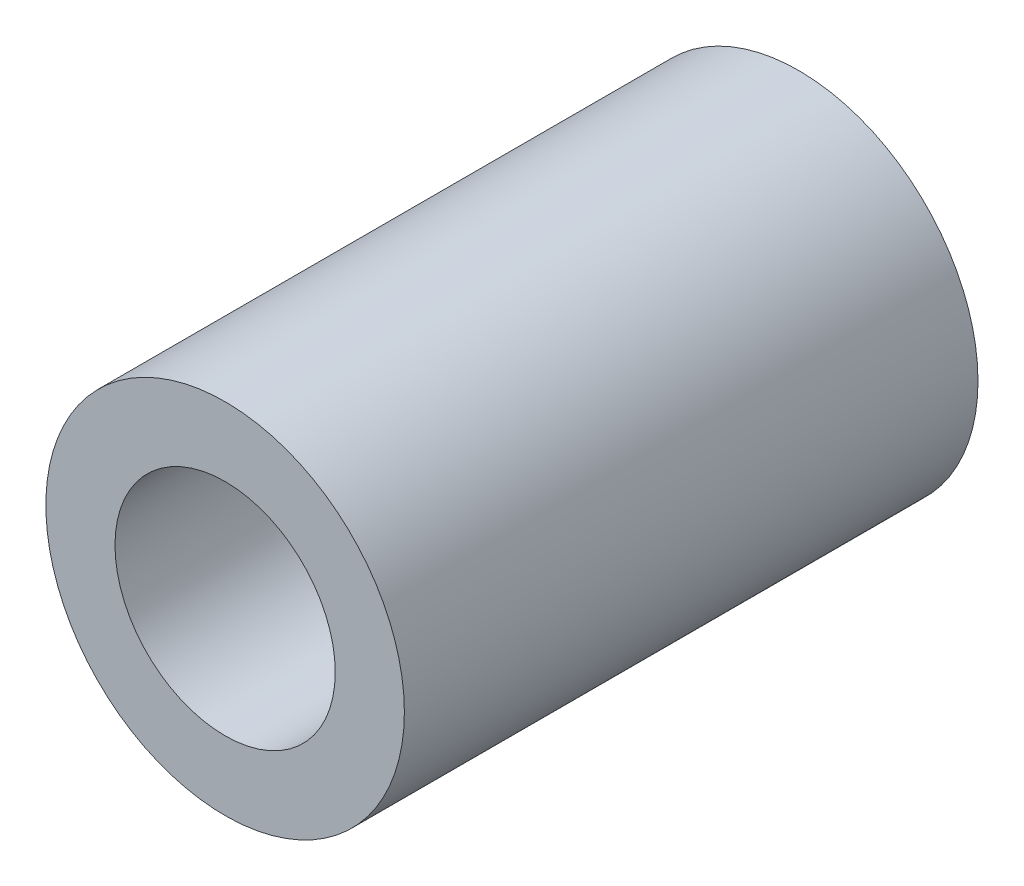
ISO-10303-21;
HEADER;
FILE_DESCRIPTION(('STEP AP214'),'2;1');
FILE_NAME('part.step','',(''),(''),'','','');
FILE_SCHEMA(('AUTOMOTIVE_DESIGN { 1 0 10303 214 1 1 1 1 }'));
ENDSEC;
DATA;
#1=APPLICATION_CONTEXT('core data for automotive mechanical design processes');
#2=APPLICATION_PROTOCOL_DEFINITION('international standard','automotive_design',2000,#1);
#3=PRODUCT_CONTEXT('',#1,'mechanical');
#4=PRODUCT('Part','Part','',(#3));
#5=PRODUCT_RELATED_PRODUCT_CATEGORY('part','',(#4));
#6=PRODUCT_DEFINITION_FORMATION('','',#4);
#7=PRODUCT_DEFINITION_CONTEXT('part definition',#1,'design');
#8=PRODUCT_DEFINITION('design','',#6,#7);
#9=PRODUCT_DEFINITION_SHAPE('','',#8);
#10=(LENGTH_UNIT() NAMED_UNIT(*) SI_UNIT(.MILLI.,.METRE.));
#11=(NAMED_UNIT(*) PLANE_ANGLE_UNIT() SI_UNIT($,.RADIAN.));
#12=(NAMED_UNIT(*) SI_UNIT($,.STERADIAN.) SOLID_ANGLE_UNIT());
#13=UNCERTAINTY_MEASURE_WITH_UNIT(LENGTH_MEASURE(1.E-05),#10,'distance_accuracy_value','');
#14=(GEOMETRIC_REPRESENTATION_CONTEXT(3) GLOBAL_UNCERTAINTY_ASSIGNED_CONTEXT((#13)) GLOBAL_UNIT_ASSIGNED_CONTEXT((#10,
#11,#12)) REPRESENTATION_CONTEXT('',''));
#15=CARTESIAN_POINT('',(0.,0.,0.));
#16=DIRECTION('',(0.,0.,1.));
#17=DIRECTION('',(1.,0.,0.));
#18=AXIS2_PLACEMENT_3D('',#15,#16,#17);
#19=CARTESIAN_POINT('',(0.,0.,6.35));
#20=DIRECTION('',(0.,0.,1.));
#21=DIRECTION('',(1.,0.,0.));
#22=AXIS2_PLACEMENT_3D('',#19,#20,#21);
#23=PLANE('',#22);
#24=CARTESIAN_POINT('',(0.,0.,6.35));
#25=DIRECTION('',(0.,0.,1.));
#26=DIRECTION('',(1.,0.,0.));
#27=AXIS2_PLACEMENT_3D('',#24,#25,#26);
#28=CIRCLE('',#27,3.96875);
#29=CARTESIAN_POINT('',(3.96875,0.,6.35));
#30=VERTEX_POINT('',#29);
#31=EDGE_CURVE('E10',#30,#30,#28,.T.);
#32=ORIENTED_EDGE('',*,*,#31,.T.);
#33=EDGE_LOOP('',(#32));
#34=FACE_BOUND('',#33,.T.);
#35=CARTESIAN_POINT('',(0.,0.,6.35));
#36=DIRECTION('',(0.,0.,1.));
#37=DIRECTION('',(1.,0.,0.));
#38=AXIS2_PLACEMENT_3D('',#35,#36,#37);
#39=CIRCLE('',#38,2.4384);
#40=CARTESIAN_POINT('',(2.4384,0.,6.35));
#41=VERTEX_POINT('',#40);
#42=EDGE_CURVE('E39',#41,#41,#39,.T.);
#43=ORIENTED_EDGE('',*,*,#42,.F.);
#44=EDGE_LOOP('',(#43));
#45=FACE_BOUND('',#44,.T.);
#46=ADVANCED_FACE('F32',(#34,#45),#23,.T.);
#47=CARTESIAN_POINT('',(0.,0.,6.35));
#48=DIRECTION('',(0.,0.,-1.));
#49=DIRECTION('',(-1.,0.,0.));
#50=AXIS2_PLACEMENT_3D('',#47,#48,#49);
#51=CYLINDRICAL_SURFACE('',#50,3.96875);
#52=ORIENTED_EDGE('',*,*,#31,.F.);
#53=EDGE_LOOP('',(#52));
#54=FACE_BOUND('',#53,.T.);
#55=CARTESIAN_POINT('',(0.,0.,-6.35));
#56=DIRECTION('',(0.,0.,1.));
#57=DIRECTION('',(1.,0.,0.));
#58=AXIS2_PLACEMENT_3D('',#55,#56,#57);
#59=CIRCLE('',#58,3.96875);
#60=CARTESIAN_POINT('',(3.96875,0.,-6.35));
#61=VERTEX_POINT('',#60);
#62=EDGE_CURVE('E43',#61,#61,#59,.T.);
#63=ORIENTED_EDGE('',*,*,#62,.T.);
#64=EDGE_LOOP('',(#63));
#65=FACE_BOUND('',#64,.T.);
#66=ADVANCED_FACE('F34',(#54,#65),#51,.T.);
#67=CARTESIAN_POINT('',(0.,0.,6.35));
#68=DIRECTION('',(0.,0.,-1.));
#69=DIRECTION('',(-1.,0.,0.));
#70=AXIS2_PLACEMENT_3D('',#67,#68,#69);
#71=CYLINDRICAL_SURFACE('',#70,2.4384);
#72=ORIENTED_EDGE('',*,*,#42,.T.);
#73=EDGE_LOOP('',(#72));
#74=FACE_BOUND('',#73,.T.);
#75=CARTESIAN_POINT('',(0.,0.,-6.35));
#76=DIRECTION('',(0.,0.,1.));
#77=DIRECTION('',(1.,0.,0.));
#78=AXIS2_PLACEMENT_3D('',#75,#76,#77);
#79=CIRCLE('',#78,2.4384);
#80=CARTESIAN_POINT('',(2.4384,0.,-6.35));
#81=VERTEX_POINT('',#80);
#82=EDGE_CURVE('E47',#81,#81,#79,.T.);
#83=ORIENTED_EDGE('',*,*,#82,.F.);
#84=EDGE_LOOP('',(#83));
#85=FACE_BOUND('',#84,.T.);
#86=ADVANCED_FACE('F56',(#74,#85),#71,.F.);
#87=CARTESIAN_POINT('',(0.,0.,-6.35));
#88=DIRECTION('',(0.,0.,1.));
#89=DIRECTION('',(1.,0.,0.));
#90=AXIS2_PLACEMENT_3D('',#87,#88,#89);
#91=PLANE('',#90);
#92=ORIENTED_EDGE('',*,*,#82,.T.);
#93=EDGE_LOOP('',(#92));
#94=FACE_BOUND('',#93,.T.);
#95=ORIENTED_EDGE('',*,*,#62,.F.);
#96=EDGE_LOOP('',(#95));
#97=FACE_BOUND('',#96,.T.);
#98=ADVANCED_FACE('F53',(#94,#97),#91,.F.);
#99=CLOSED_SHELL('',(#46,#66,#86,#98));
#100=MANIFOLD_SOLID_BREP('B2',#99);
#101=ADVANCED_BREP_SHAPE_REPRESENTATION('',(#18,#100),#14);
#102=SHAPE_DEFINITION_REPRESENTATION(#9,#101);
ENDSEC;
END-ISO-10303-21;
